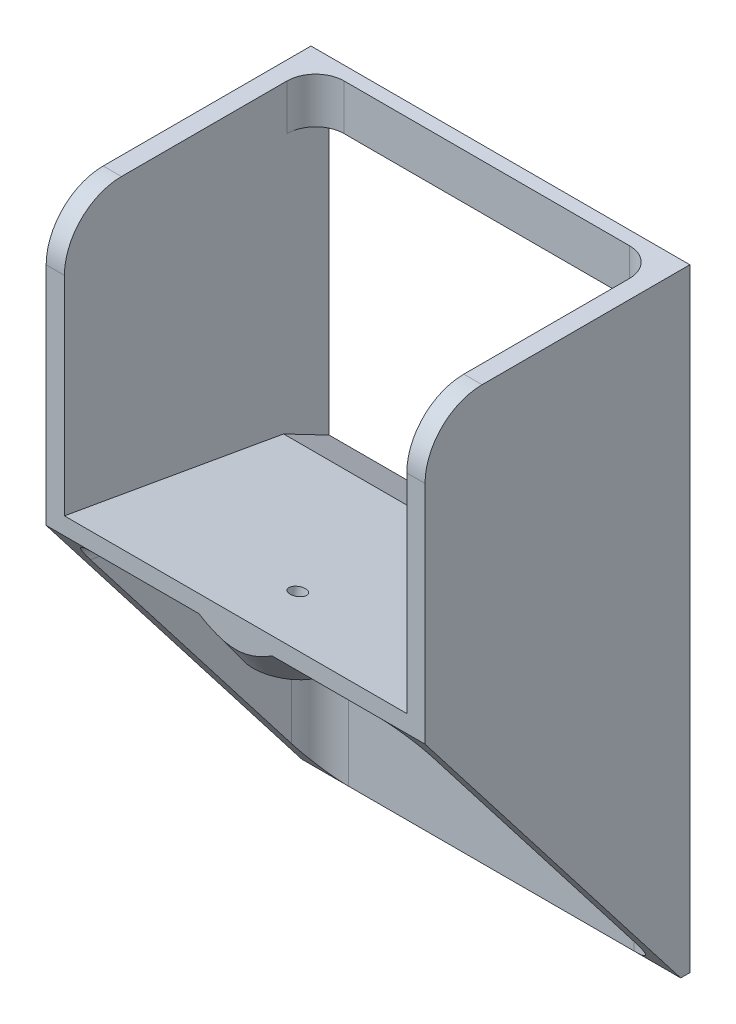
ISO-10303-21;
HEADER;
FILE_DESCRIPTION(('STEP AP214'),'2;1');
FILE_NAME('part.step','',(''),(''),'','','');
FILE_SCHEMA(('AUTOMOTIVE_DESIGN { 1 0 10303 214 1 1 1 1 }'));
ENDSEC;
DATA;
#1=APPLICATION_CONTEXT('core data for automotive mechanical design processes');
#2=APPLICATION_PROTOCOL_DEFINITION('international standard','automotive_design',2000,#1);
#3=PRODUCT_CONTEXT('',#1,'mechanical');
#4=PRODUCT('Part','Part','',(#3));
#5=PRODUCT_RELATED_PRODUCT_CATEGORY('part','',(#4));
#6=PRODUCT_DEFINITION_FORMATION('','',#4);
#7=PRODUCT_DEFINITION_CONTEXT('part definition',#1,'design');
#8=PRODUCT_DEFINITION('design','',#6,#7);
#9=PRODUCT_DEFINITION_SHAPE('','',#8);
#10=(LENGTH_UNIT() NAMED_UNIT(*) SI_UNIT(.MILLI.,.METRE.));
#11=(NAMED_UNIT(*) PLANE_ANGLE_UNIT() SI_UNIT($,.RADIAN.));
#12=(NAMED_UNIT(*) SI_UNIT($,.STERADIAN.) SOLID_ANGLE_UNIT());
#13=UNCERTAINTY_MEASURE_WITH_UNIT(LENGTH_MEASURE(1.E-05),#10,'distance_accuracy_value','');
#14=(GEOMETRIC_REPRESENTATION_CONTEXT(3) GLOBAL_UNCERTAINTY_ASSIGNED_CONTEXT((#13)) GLOBAL_UNIT_ASSIGNED_CONTEXT((#10,
#11,#12)) REPRESENTATION_CONTEXT('',''));
#15=CARTESIAN_POINT('',(0.,0.,0.));
#16=DIRECTION('',(0.,0.,1.));
#17=DIRECTION('',(1.,0.,0.));
#18=AXIS2_PLACEMENT_3D('',#15,#16,#17);
#19=CARTESIAN_POINT('',(30.,0.,0.));
#20=DIRECTION('',(1.,0.,0.));
#21=DIRECTION('',(0.,0.,-1.));
#22=AXIS2_PLACEMENT_3D('',#19,#20,#21);
#23=PLANE('',#22);
#24=DIRECTION('',(0.,-1.,0.));
#25=VECTOR('',#24,1.);
#26=CARTESIAN_POINT('',(30.,107.458907360345,46.4141984621045));
#27=LINE('',#26,#25);
#28=CARTESIAN_POINT('',(30.,97.4589073603453,46.4141984621045));
#29=VERTEX_POINT('',#28);
#30=CARTESIAN_POINT('',(30.,60.9482321433499,46.4141984621045));
#31=VERTEX_POINT('',#30);
#32=EDGE_CURVE('E240',#29,#31,#27,.T.);
#33=ORIENTED_EDGE('',*,*,#32,.F.);
#34=CARTESIAN_POINT('',(30.,97.4589073603452,36.4141984621041));
#35=DIRECTION('',(1.,0.,0.));
#36=DIRECTION('',(0.,0.,-1.));
#37=AXIS2_PLACEMENT_3D('',#34,#35,#36);
#38=CIRCLE('',#37,10.);
#39=CARTESIAN_POINT('',(30.,107.458907360345,36.4141984621041));
#40=VERTEX_POINT('',#39);
#41=EDGE_CURVE('E52',#29,#40,#38,.F.);
#42=ORIENTED_EDGE('',*,*,#41,.T.);
#43=DIRECTION('',(0.,0.,1.));
#44=VECTOR('',#43,1.);
#45=CARTESIAN_POINT('',(30.,107.458907360345,0.));
#46=LINE('',#45,#44);
#47=CARTESIAN_POINT('',(30.,107.458907360345,7.40000000000001));
#48=VERTEX_POINT('',#47);
#49=EDGE_CURVE('E234',#48,#40,#46,.T.);
#50=ORIENTED_EDGE('',*,*,#49,.F.);
#51=DIRECTION('',(0.,1.,0.));
#52=VECTOR('',#51,1.);
#53=CARTESIAN_POINT('',(30.,99.4589073602959,7.4));
#54=LINE('',#53,#52);
#55=CARTESIAN_POINT('',(30.,99.4589073602959,7.4));
#56=VERTEX_POINT('',#55);
#57=EDGE_CURVE('E224',#48,#56,#54,.F.);
#58=ORIENTED_EDGE('',*,*,#57,.T.);
#59=DIRECTION('',(0.,0.,1.));
#60=VECTOR('',#59,1.);
#61=CARTESIAN_POINT('',(30.,99.4589073602959,0.));
#62=LINE('',#61,#60);
#63=CARTESIAN_POINT('',(30.,99.4589073602959,0.));
#64=VERTEX_POINT('',#63);
#65=EDGE_CURVE('E208',#64,#56,#62,.T.);
#66=ORIENTED_EDGE('',*,*,#65,.F.);
#67=DIRECTION('',(0.,1.,0.));
#68=VECTOR('',#67,1.);
#69=CARTESIAN_POINT('',(30.,0.,0.));
#70=LINE('',#69,#68);
#71=CARTESIAN_POINT('',(30.,50.,0.));
#72=VERTEX_POINT('',#71);
#73=EDGE_CURVE('E221',#72,#64,#70,.T.);
#74=ORIENTED_EDGE('',*,*,#73,.F.);
#75=DIRECTION('',(0.,0.4626408705685,0.886545782731845));
#76=VECTOR('',#75,1.);
#77=CARTESIAN_POINT('',(30.,39.298171243981,-20.5076156360947));
#78=LINE('',#77,#76);
#79=CARTESIAN_POINT('',(30.,54.1747725121913,8.));
#80=VERTEX_POINT('',#79);
#81=EDGE_CURVE('E268',#72,#80,#78,.T.);
#82=ORIENTED_EDGE('',*,*,#81,.T.);
#83=DIRECTION('',(0.,0.173648177666931,0.984807753012208));
#84=VECTOR('',#83,1.);
#85=CARTESIAN_POINT('',(30.,51.1731226640236,-9.02320221277126));
#86=LINE('',#85,#84);
#87=EDGE_CURVE('E264',#80,#31,#86,.T.);
#88=ORIENTED_EDGE('',*,*,#87,.T.);
#89=EDGE_LOOP('',(#33,#42,#50,#58,#66,#74,#82,#88));
#90=FACE_BOUND('',#89,.T.);
#91=ADVANCED_FACE('F43',(#90),#23,.F.);
#92=CARTESIAN_POINT('',(-30.,0.,0.));
#93=DIRECTION('',(-1.,0.,0.));
#94=DIRECTION('',(0.,0.,-1.));
#95=AXIS2_PLACEMENT_3D('',#92,#93,#94);
#96=PLANE('',#95);
#97=DIRECTION('',(0.,0.,1.));
#98=VECTOR('',#97,1.);
#99=CARTESIAN_POINT('',(-30.,107.458907360345,0.));
#100=LINE('',#99,#98);
#101=CARTESIAN_POINT('',(-30.,107.458907360345,7.40000000000001));
#102=VERTEX_POINT('',#101);
#103=CARTESIAN_POINT('',(-30.,107.458907360345,36.4141984621041));
#104=VERTEX_POINT('',#103);
#105=EDGE_CURVE('E483',#102,#104,#100,.T.);
#106=ORIENTED_EDGE('',*,*,#105,.T.);
#107=CARTESIAN_POINT('',(-30.,97.4589073603452,36.4141984621041));
#108=DIRECTION('',(-1.,0.,0.));
#109=DIRECTION('',(0.,0.,1.));
#110=AXIS2_PLACEMENT_3D('',#107,#108,#109);
#111=CIRCLE('',#110,10.);
#112=CARTESIAN_POINT('',(-30.,97.4589073603453,46.4141984621045));
#113=VERTEX_POINT('',#112);
#114=EDGE_CURVE('E442',#104,#113,#111,.F.);
#115=ORIENTED_EDGE('',*,*,#114,.T.);
#116=DIRECTION('',(0.,-1.,0.));
#117=VECTOR('',#116,1.);
#118=CARTESIAN_POINT('',(-30.,107.458907360345,46.4141984621045));
#119=LINE('',#118,#117);
#120=CARTESIAN_POINT('',(-30.,60.9482321433499,46.4141984621045));
#121=VERTEX_POINT('',#120);
#122=EDGE_CURVE('E487',#113,#121,#119,.T.);
#123=ORIENTED_EDGE('',*,*,#122,.T.);
#124=DIRECTION('',(0.,0.173648177666931,0.984807753012208));
#125=VECTOR('',#124,1.);
#126=CARTESIAN_POINT('',(-30.,51.1731226640236,-9.02320221277126));
#127=LINE('',#126,#125);
#128=CARTESIAN_POINT('',(-30.,54.1747725121913,8.));
#129=VERTEX_POINT('',#128);
#130=EDGE_CURVE('E271',#129,#121,#127,.T.);
#131=ORIENTED_EDGE('',*,*,#130,.F.);
#132=DIRECTION('',(0.,0.4626408705685,0.886545782731845));
#133=VECTOR('',#132,1.);
#134=CARTESIAN_POINT('',(-30.,39.298171243981,-20.5076156360947));
#135=LINE('',#134,#133);
#136=CARTESIAN_POINT('',(-30.,50.,0.));
#137=VERTEX_POINT('',#136);
#138=EDGE_CURVE('E275',#137,#129,#135,.T.);
#139=ORIENTED_EDGE('',*,*,#138,.F.);
#140=DIRECTION('',(0.,1.,0.));
#141=VECTOR('',#140,1.);
#142=CARTESIAN_POINT('',(-30.,0.,0.));
#143=LINE('',#142,#141);
#144=CARTESIAN_POINT('',(-30.,99.4589073602959,0.));
#145=VERTEX_POINT('',#144);
#146=EDGE_CURVE('E479',#137,#145,#143,.T.);
#147=ORIENTED_EDGE('',*,*,#146,.T.);
#148=DIRECTION('',(0.,0.,1.));
#149=VECTOR('',#148,1.);
#150=CARTESIAN_POINT('',(-30.,99.4589073602959,0.));
#151=LINE('',#150,#149);
#152=CARTESIAN_POINT('',(-30.,99.4589073602959,7.4));
#153=VERTEX_POINT('',#152);
#154=EDGE_CURVE('E211',#145,#153,#151,.T.);
#155=ORIENTED_EDGE('',*,*,#154,.T.);
#156=DIRECTION('',(0.,1.,0.));
#157=VECTOR('',#156,1.);
#158=CARTESIAN_POINT('',(-30.,107.458907360296,7.40000000000001));
#159=LINE('',#158,#157);
#160=EDGE_CURVE('E409',#153,#102,#159,.T.);
#161=ORIENTED_EDGE('',*,*,#160,.T.);
#162=EDGE_LOOP('',(#106,#115,#123,#131,#139,#147,#155,#161));
#163=FACE_BOUND('',#162,.T.);
#164=ADVANCED_FACE('F338',(#163),#96,.F.);
#165=CARTESIAN_POINT('',(-30.,48.218699404987,-8.50225767977049));
#166=DIRECTION('',(0.,0.984807753012208,-0.173648177666932));
#167=DIRECTION('',(0.,0.173648177666932,0.984807753012208));
#168=AXIS2_PLACEMENT_3D('',#165,#166,#167);
#169=PLANE('',#168);
#170=DIRECTION('',(1.,0.,0.));
#171=VECTOR('',#170,1.);
#172=CARTESIAN_POINT('',(-30.,57.9019523076927,46.4141984621045));
#173=LINE('',#172,#171);
#174=CARTESIAN_POINT('',(-25.,57.9019523076927,46.4141984621045));
#175=VERTEX_POINT('',#174);
#176=CARTESIAN_POINT('',(-6.42331588124305,57.9019523076927,46.4141984621045));
#177=VERTEX_POINT('',#176);
#178=EDGE_CURVE('E294',#175,#177,#173,.T.);
#179=ORIENTED_EDGE('',*,*,#178,.F.);
#180=DIRECTION('',(0.,0.173648177666932,0.984807753012208));
#181=VECTOR('',#180,1.);
#182=CARTESIAN_POINT('',(-25.,49.9999999999998,1.6));
#183=LINE('',#182,#181);
#184=CARTESIAN_POINT('',(-25.,50.7285406091745,5.73175911166534));
#185=VERTEX_POINT('',#184);
#186=EDGE_CURVE('E554',#175,#185,#183,.F.);
#187=ORIENTED_EDGE('',*,*,#186,.T.);
#188=DIRECTION('',(1.,0.,0.));
#189=VECTOR('',#188,1.);
#190=CARTESIAN_POINT('',(30.,50.7285406091745,5.73175911166534));
#191=LINE('',#190,#189);
#192=CARTESIAN_POINT('',(25.,50.7285406091745,5.73175911166534));
#193=VERTEX_POINT('',#192);
#194=EDGE_CURVE('E552',#185,#193,#191,.T.);
#195=ORIENTED_EDGE('',*,*,#194,.T.);
#196=DIRECTION('',(0.,0.173648177666932,0.984807753012208));
#197=VECTOR('',#196,1.);
#198=CARTESIAN_POINT('',(25.,57.9019523076927,46.4141984621045));
#199=LINE('',#198,#197);
#200=CARTESIAN_POINT('',(25.,57.9019523076927,46.4141984621045));
#201=VERTEX_POINT('',#200);
#202=EDGE_CURVE('E393',#193,#201,#199,.T.);
#203=ORIENTED_EDGE('',*,*,#202,.T.);
#204=CARTESIAN_POINT('',(6.42331588124305,57.9019523076927,46.4141984621045));
#205=VERTEX_POINT('',#204);
#206=EDGE_CURVE('E297',#205,#201,#173,.T.);
#207=ORIENTED_EDGE('',*,*,#206,.F.);
#208=CARTESIAN_POINT('',(0.,56.0702849147694,36.026296477032));
#209=DIRECTION('',(0.,0.984807753012208,-0.173648177666932));
#210=DIRECTION('',(0.,0.173648177666932,0.984807753012208));
#211=AXIS2_PLACEMENT_3D('',#208,#209,#210);
#212=CIRCLE('',#211,12.35);
#213=EDGE_CURVE('E284',#205,#177,#212,.T.);
#214=ORIENTED_EDGE('',*,*,#213,.T.);
#215=EDGE_LOOP('',(#179,#187,#195,#203,#207,#214));
#216=FACE_BOUND('',#215,.T.);
#217=ADVANCED_FACE('F326',(#216),#169,.F.);
#218=CARTESIAN_POINT('',(-30.,51.1731226640236,-9.02320221277126));
#219=DIRECTION('',(0.,0.984807753012208,-0.173648177666931));
#220=DIRECTION('',(0.,0.173648177666931,0.984807753012208));
#221=AXIS2_PLACEMENT_3D('',#218,#219,#220);
#222=PLANE('',#221);
#223=CARTESIAN_POINT('',(0.,59.0247081738061,35.5053519440312));
#224=DIRECTION('',(0.,0.984807753012208,-0.173648177666931));
#225=DIRECTION('',(0.,0.173648177666931,0.984807753012208));
#226=AXIS2_PLACEMENT_3D('',#223,#224,#225);
#227=CIRCLE('',#226,1.34999999999999);
#228=CARTESIAN_POINT('',(0.,59.2591332136564,36.8348424105977));
#229=VERTEX_POINT('',#228);
#230=EDGE_CURVE('E494',#229,#229,#227,.T.);
#231=ORIENTED_EDGE('',*,*,#230,.F.);
#232=EDGE_LOOP('',(#231));
#233=FACE_BOUND('',#232,.T.);
#234=DIRECTION('',(1.,0.,0.));
#235=VECTOR('',#234,1.);
#236=CARTESIAN_POINT('',(-30.,60.9482321433499,46.4141984621045));
#237=LINE('',#236,#235);
#238=EDGE_CURVE('E279',#121,#31,#237,.T.);
#239=ORIENTED_EDGE('',*,*,#238,.T.);
#240=ORIENTED_EDGE('',*,*,#87,.F.);
#241=DIRECTION('',(1.,0.,0.));
#242=VECTOR('',#241,1.);
#243=CARTESIAN_POINT('',(-30.,54.1747725121913,8.));
#244=LINE('',#243,#242);
#245=EDGE_CURVE('E280',#129,#80,#244,.T.);
#246=ORIENTED_EDGE('',*,*,#245,.F.);
#247=ORIENTED_EDGE('',*,*,#130,.T.);
#248=EDGE_LOOP('',(#239,#240,#246,#247));
#249=FACE_BOUND('',#248,.T.);
#250=ADVANCED_FACE('F328',(#233,#249),#222,.T.);
#251=CARTESIAN_POINT('',(-30.,39.298171243981,-20.5076156360947));
#252=DIRECTION('',(0.,0.886545782731845,-0.4626408705685));
#253=DIRECTION('',(0.,0.4626408705685,0.886545782731845));
#254=AXIS2_PLACEMENT_3D('',#251,#252,#253);
#255=PLANE('',#254);
#256=ORIENTED_EDGE('',*,*,#245,.T.);
#257=ORIENTED_EDGE('',*,*,#81,.F.);
#258=DIRECTION('',(1.,0.,0.));
#259=VECTOR('',#258,1.);
#260=CARTESIAN_POINT('',(-30.,50.,0.));
#261=LINE('',#260,#259);
#262=EDGE_CURVE('E231',#137,#72,#261,.T.);
#263=ORIENTED_EDGE('',*,*,#262,.F.);
#264=ORIENTED_EDGE('',*,*,#138,.T.);
#265=EDGE_LOOP('',(#256,#257,#263,#264));
#266=FACE_BOUND('',#265,.T.);
#267=ADVANCED_FACE('F330',(#266),#255,.T.);
#268=CARTESIAN_POINT('',(-30.,0.,0.));
#269=DIRECTION('',(0.,0.,-1.));
#270=DIRECTION('',(-1.,0.,0.));
#271=AXIS2_PLACEMENT_3D('',#268,#269,#270);
#272=PLANE('',#271);
#273=ORIENTED_EDGE('',*,*,#73,.T.);
#274=DIRECTION('',(1.,0.,0.));
#275=VECTOR('',#274,1.);
#276=CARTESIAN_POINT('',(-38.3522452071284,99.4589073602959,0.));
#277=LINE('',#276,#275);
#278=EDGE_CURVE('E205',#145,#64,#277,.T.);
#279=ORIENTED_EDGE('',*,*,#278,.F.);
#280=ORIENTED_EDGE('',*,*,#146,.F.);
#281=ORIENTED_EDGE('',*,*,#262,.T.);
#282=EDGE_LOOP('',(#273,#279,#280,#281));
#283=FACE_BOUND('',#282,.T.);
#284=DIRECTION('',(0.,1.,0.));
#285=VECTOR('',#284,1.);
#286=CARTESIAN_POINT('',(-33.2,0.,0.));
#287=LINE('',#286,#285);
#288=CARTESIAN_POINT('',(-33.2,0.,0.));
#289=VERTEX_POINT('',#288);
#290=CARTESIAN_POINT('',(-33.2,107.458907360345,0.));
#291=VERTEX_POINT('',#290);
#292=EDGE_CURVE('E478',#289,#291,#287,.T.);
#293=ORIENTED_EDGE('',*,*,#292,.T.);
#294=DIRECTION('',(-1.,0.,0.));
#295=VECTOR('',#294,1.);
#296=CARTESIAN_POINT('',(33.2,107.458907360345,0.));
#297=LINE('',#296,#295);
#298=CARTESIAN_POINT('',(33.2,107.458907360345,0.));
#299=VERTEX_POINT('',#298);
#300=EDGE_CURVE('E261',#299,#291,#297,.T.);
#301=ORIENTED_EDGE('',*,*,#300,.F.);
#302=DIRECTION('',(0.,1.,0.));
#303=VECTOR('',#302,1.);
#304=CARTESIAN_POINT('',(33.2,0.,0.));
#305=LINE('',#304,#303);
#306=CARTESIAN_POINT('',(33.2,0.,0.));
#307=VERTEX_POINT('',#306);
#308=EDGE_CURVE('E468',#307,#299,#305,.T.);
#309=ORIENTED_EDGE('',*,*,#308,.F.);
#310=DIRECTION('',(1.,0.,0.));
#311=VECTOR('',#310,1.);
#312=CARTESIAN_POINT('',(-30.,0.,0.));
#313=LINE('',#312,#311);
#314=EDGE_CURVE('E287',#289,#307,#313,.T.);
#315=ORIENTED_EDGE('',*,*,#314,.F.);
#316=EDGE_LOOP('',(#293,#301,#309,#315));
#317=FACE_BOUND('',#316,.T.);
#318=ADVANCED_FACE('F229',(#283,#317),#272,.T.);
#319=CARTESIAN_POINT('',(-30.,0.,0.));
#320=DIRECTION('',(0.,1.,0.));
#321=DIRECTION('',(0.,0.,1.));
#322=AXIS2_PLACEMENT_3D('',#319,#320,#321);
#323=PLANE('',#322);
#324=ORIENTED_EDGE('',*,*,#314,.T.);
#325=DIRECTION('',(0.,0.,-1.));
#326=VECTOR('',#325,1.);
#327=CARTESIAN_POINT('',(33.2,0.,1.6));
#328=LINE('',#327,#326);
#329=CARTESIAN_POINT('',(33.2,0.,1.6));
#330=VERTEX_POINT('',#329);
#331=EDGE_CURVE('E254',#330,#307,#328,.T.);
#332=ORIENTED_EDGE('',*,*,#331,.F.);
#333=DIRECTION('',(-1.,0.,0.));
#334=VECTOR('',#333,1.);
#335=CARTESIAN_POINT('',(33.2,0.,1.6));
#336=LINE('',#335,#334);
#337=CARTESIAN_POINT('',(25.,0.,1.6));
#338=VERTEX_POINT('',#337);
#339=EDGE_CURVE('E255',#330,#338,#336,.T.);
#340=ORIENTED_EDGE('',*,*,#339,.T.);
#341=DIRECTION('',(1.,0.,0.));
#342=VECTOR('',#341,1.);
#343=CARTESIAN_POINT('',(-30.,0.,1.6));
#344=LINE('',#343,#342);
#345=CARTESIAN_POINT('',(-25.,0.,1.6));
#346=VERTEX_POINT('',#345);
#347=EDGE_CURVE('E290',#346,#338,#344,.T.);
#348=ORIENTED_EDGE('',*,*,#347,.F.);
#349=DIRECTION('',(1.,0.,0.));
#350=VECTOR('',#349,1.);
#351=CARTESIAN_POINT('',(-33.2,0.,1.6));
#352=LINE('',#351,#350);
#353=CARTESIAN_POINT('',(-33.2,0.,1.6));
#354=VERTEX_POINT('',#353);
#355=EDGE_CURVE('E235',#354,#346,#352,.T.);
#356=ORIENTED_EDGE('',*,*,#355,.F.);
#357=DIRECTION('',(0.,0.,-1.));
#358=VECTOR('',#357,1.);
#359=CARTESIAN_POINT('',(-33.2,0.,1.6));
#360=LINE('',#359,#358);
#361=EDGE_CURVE('E482',#354,#289,#360,.T.);
#362=ORIENTED_EDGE('',*,*,#361,.T.);
#363=EDGE_LOOP('',(#324,#332,#340,#348,#356,#362));
#364=FACE_BOUND('',#363,.T.);
#365=ADVANCED_FACE('F598',(#364),#323,.F.);
#366=CARTESIAN_POINT('',(-30.,0.,1.6));
#367=DIRECTION('',(0.,0.,-1.));
#368=DIRECTION('',(-1.,0.,0.));
#369=AXIS2_PLACEMENT_3D('',#366,#367,#368);
#370=PLANE('',#369);
#371=DIRECTION('',(1.,0.,0.));
#372=VECTOR('',#371,1.);
#373=CARTESIAN_POINT('',(-30.,45.8045018441134,1.6));
#374=LINE('',#373,#372);
#375=CARTESIAN_POINT('',(25.,45.8045018441134,1.6));
#376=VERTEX_POINT('',#375);
#377=CARTESIAN_POINT('',(-25.,45.8045018441134,1.6));
#378=VERTEX_POINT('',#377);
#379=EDGE_CURVE('E551',#376,#378,#374,.F.);
#380=ORIENTED_EDGE('',*,*,#379,.T.);
#381=DIRECTION('',(0.,1.,0.));
#382=VECTOR('',#381,1.);
#383=CARTESIAN_POINT('',(-25.,0.,1.6));
#384=LINE('',#383,#382);
#385=EDGE_CURVE('E373',#378,#346,#384,.F.);
#386=ORIENTED_EDGE('',*,*,#385,.T.);
#387=ORIENTED_EDGE('',*,*,#347,.T.);
#388=DIRECTION('',(0.,1.,0.));
#389=VECTOR('',#388,1.);
#390=CARTESIAN_POINT('',(25.,49.9999999999998,1.6));
#391=LINE('',#390,#389);
#392=EDGE_CURVE('E558',#338,#376,#391,.T.);
#393=ORIENTED_EDGE('',*,*,#392,.T.);
#394=EDGE_LOOP('',(#380,#386,#387,#393));
#395=FACE_BOUND('',#394,.T.);
#396=ADVANCED_FACE('F325',(#395),#370,.F.);
#397=CARTESIAN_POINT('',(-30.,5.28617225170252E-13,46.4141984621052));
#398=DIRECTION('',(0.,0.,1.));
#399=DIRECTION('',(0.,-1.,0.));
#400=AXIS2_PLACEMENT_3D('',#397,#398,#399);
#401=PLANE('',#400);
#402=ORIENTED_EDGE('',*,*,#122,.F.);
#403=DIRECTION('',(1.,0.,0.));
#404=VECTOR('',#403,1.);
#405=CARTESIAN_POINT('',(-33.2,97.4589073603453,46.4141984621041));
#406=LINE('',#405,#404);
#407=CARTESIAN_POINT('',(-33.2,97.4589073603453,46.4141984621045));
#408=VERTEX_POINT('',#407);
#409=EDGE_CURVE('E59',#113,#408,#406,.F.);
#410=ORIENTED_EDGE('',*,*,#409,.T.);
#411=DIRECTION('',(0.,-1.,0.));
#412=VECTOR('',#411,1.);
#413=CARTESIAN_POINT('',(-33.2,107.458907360345,46.4141984621045));
#414=LINE('',#413,#412);
#415=CARTESIAN_POINT('',(-33.2,57.9019523076927,46.4141984621045));
#416=VERTEX_POINT('',#415);
#417=EDGE_CURVE('E501',#408,#416,#414,.T.);
#418=ORIENTED_EDGE('',*,*,#417,.T.);
#419=DIRECTION('',(1.,0.,0.));
#420=VECTOR('',#419,1.);
#421=CARTESIAN_POINT('',(-33.2,57.9019523076927,46.4141984621045));
#422=LINE('',#421,#420);
#423=EDGE_CURVE('E242',#416,#175,#422,.T.);
#424=ORIENTED_EDGE('',*,*,#423,.T.);
#425=ORIENTED_EDGE('',*,*,#178,.T.);
#426=CARTESIAN_POINT('',(-6.42331588124305,57.9019523076927,46.4141984621045));
#427=CARTESIAN_POINT('',(-6.26439593139787,57.8031556321546,46.4141984621045));
#428=CARTESIAN_POINT('',(-6.10443126975021,57.7060151763486,46.4141984621045));
#429=CARTESIAN_POINT('',(-5.78217947743647,57.5155702634718,46.4141984621045));
#430=CARTESIAN_POINT('',(-5.61989173741623,57.4222668386825,46.4141984621045));
#431=CARTESIAN_POINT('',(-5.29210777390077,57.2396619729198,46.4141984621045));
#432=CARTESIAN_POINT('',(-5.1266003786054,57.1503804856044,46.4141984621045));
#433=CARTESIAN_POINT('',(-4.79293191611986,56.9769653003287,46.4141984621045));
#434=CARTESIAN_POINT('',(-4.6247710323839,56.8928312484348,46.4141984621045));
#435=CARTESIAN_POINT('',(-4.10935937560402,56.6460711785689,46.4141984621045));
#436=CARTESIAN_POINT('',(-3.75756677374156,56.4927161221843,46.4141984621045));
#437=CARTESIAN_POINT('',(-3.04188202735353,56.2187057802107,46.4141984621045));
#438=CARTESIAN_POINT('',(-2.67801307014992,56.0979914869066,46.4141984621045));
#439=CARTESIAN_POINT('',(-2.0669846617319,55.9328502740829,46.4141984621045));
#440=CARTESIAN_POINT('',(-1.82305496981243,55.8764820686315,46.4141984621045));
#441=CARTESIAN_POINT('',(-1.33131205210018,55.7839835124456,46.4141984621045));
#442=CARTESIAN_POINT('',(-1.08349871579766,55.7478537386778,46.4141984621045));
#443=CARTESIAN_POINT('',(-0.587968175075757,55.6979289325463,46.4141984621045));
#444=CARTESIAN_POINT('',(-0.34027217799189,55.6839261321277,46.4141984621045));
#445=CARTESIAN_POINT('',(0.155365249435748,55.6783682293351,46.4141984621045));
#446=CARTESIAN_POINT('',(0.40330666972946,55.686812242927,46.4141984621045));
#447=CARTESIAN_POINT('',(0.897013156804226,55.7256491873362,46.4141984621045));
#448=CARTESIAN_POINT('',(1.14278124735932,55.7560041088122,46.4141984621045));
#449=CARTESIAN_POINT('',(1.63088787294762,55.8370389475244,46.4141984621045));
#450=CARTESIAN_POINT('',(1.87322604327814,55.8877210095801,46.4141984621045));
#451=CARTESIAN_POINT('',(2.59754574583653,56.0679517047776,46.4141984621045));
#452=CARTESIAN_POINT('',(3.07272018280399,56.2252995271422,46.4141984621045));
#453=CARTESIAN_POINT('',(3.79121755091877,56.5098806976264,46.4141984621045));
#454=CARTESIAN_POINT('',(4.04236974853014,56.618642795611,46.4141984621045));
#455=CARTESIAN_POINT('',(4.53871597514699,56.8493002295549,46.4141984621045));
#456=CARTESIAN_POINT('',(4.78390817898631,56.9711995280203,46.4141984621045));
#457=CARTESIAN_POINT('',(5.26430357865823,57.22334708926,46.4141984621045));
#458=CARTESIAN_POINT('',(5.49960701940132,57.3534068089431,46.4141984621045));
#459=CARTESIAN_POINT('',(5.96509019944598,57.6218540838451,46.4141984621045));
#460=CARTESIAN_POINT('',(6.19527517651469,57.7602325331518,46.4141984621045));
#461=CARTESIAN_POINT('',(6.42331588124305,57.9019523076927,46.4141984621045));
#462=B_SPLINE_CURVE_WITH_KNOTS('',3,(#426,#427,#428,#429,#430,#431,#432,#433,#434,#435,#436,
#437,#438,#439,#440,#441,#442,#443,#444,#445,#446,#447,#448,#449,#450,#451,#452,#453,#454,#455,
#456,#457,#458,#459,#460,#461),.UNSPECIFIED.,.F.,.F.,(4,2,2,2,2,2,2,2,2,2,2,2,2,2,2,2,2,4),(0.,
0.561387489664002,1.12292503507966,1.68699591589626,2.25102796794616,3.4010872056482,
4.54905326020081,5.29939593791521,6.04976000566082,6.79303551630654,7.53628175458879,
8.27824175610839,9.02028006618695,10.5166098965658,11.3374506853978,12.158539756826,
12.9649288230825,13.7704507223679),.UNSPECIFIED.);
#463=EDGE_CURVE('E304',#177,#205,#462,.T.);
#464=ORIENTED_EDGE('',*,*,#463,.T.);
#465=ORIENTED_EDGE('',*,*,#206,.T.);
#466=DIRECTION('',(-1.,0.,0.));
#467=VECTOR('',#466,1.);
#468=CARTESIAN_POINT('',(33.2,57.9019523076927,46.4141984621045));
#469=LINE('',#468,#467);
#470=CARTESIAN_POINT('',(33.2,57.9019523076927,46.4141984621045));
#471=VERTEX_POINT('',#470);
#472=EDGE_CURVE('E258',#471,#201,#469,.T.);
#473=ORIENTED_EDGE('',*,*,#472,.F.);
#474=DIRECTION('',(0.,-1.,0.));
#475=VECTOR('',#474,1.);
#476=CARTESIAN_POINT('',(33.2,107.458907360345,46.4141984621045));
#477=LINE('',#476,#475);
#478=CARTESIAN_POINT('',(33.2,97.4589073603453,46.4141984621045));
#479=VERTEX_POINT('',#478);
#480=EDGE_CURVE('E460',#479,#471,#477,.T.);
#481=ORIENTED_EDGE('',*,*,#480,.F.);
#482=DIRECTION('',(-1.,0.,0.));
#483=VECTOR('',#482,1.);
#484=CARTESIAN_POINT('',(30.,97.4589073603453,46.4141984621041));
#485=LINE('',#484,#483);
#486=EDGE_CURVE('E445',#479,#29,#485,.T.);
#487=ORIENTED_EDGE('',*,*,#486,.T.);
#488=ORIENTED_EDGE('',*,*,#32,.T.);
#489=ORIENTED_EDGE('',*,*,#238,.F.);
#490=EDGE_LOOP('',(#402,#410,#418,#424,#425,#464,#465,#473,#481,#487,#488,#489));
#491=FACE_BOUND('',#490,.T.);
#492=ADVANCED_FACE('F320',(#491),#401,.T.);
#493=CARTESIAN_POINT('',(33.2,107.458907360345,0.));
#494=DIRECTION('',(0.,-1.,0.));
#495=DIRECTION('',(0.,0.,-1.));
#496=AXIS2_PLACEMENT_3D('',#493,#494,#495);
#497=PLANE('',#496);
#498=DIRECTION('',(0.,0.,1.));
#499=VECTOR('',#498,1.);
#500=CARTESIAN_POINT('',(-33.2,107.458907360345,0.));
#501=LINE('',#500,#499);
#502=CARTESIAN_POINT('',(-33.2,107.458907360345,36.4141984621041));
#503=VERTEX_POINT('',#502);
#504=EDGE_CURVE('E498',#291,#503,#501,.T.);
#505=ORIENTED_EDGE('',*,*,#504,.T.);
#506=DIRECTION('',(1.,0.,0.));
#507=VECTOR('',#506,1.);
#508=CARTESIAN_POINT('',(-30.,107.458907360345,36.4141984621041));
#509=LINE('',#508,#507);
#510=EDGE_CURVE('E438',#503,#104,#509,.T.);
#511=ORIENTED_EDGE('',*,*,#510,.T.);
#512=ORIENTED_EDGE('',*,*,#105,.F.);
#513=CARTESIAN_POINT('',(-25.,107.458907360345,7.40000000000001));
#514=DIRECTION('',(0.,-1.,0.));
#515=DIRECTION('',(0.,0.,-1.));
#516=AXIS2_PLACEMENT_3D('',#513,#514,#515);
#517=CIRCLE('',#516,5.);
#518=CARTESIAN_POINT('',(-25.,107.458907360296,2.40000000000001));
#519=VERTEX_POINT('',#518);
#520=EDGE_CURVE('E423',#102,#519,#517,.T.);
#521=ORIENTED_EDGE('',*,*,#520,.T.);
#522=DIRECTION('',(1.,0.,0.));
#523=VECTOR('',#522,1.);
#524=CARTESIAN_POINT('',(-38.3522452071284,107.458907360296,2.40000000000001));
#525=LINE('',#524,#523);
#526=CARTESIAN_POINT('',(25.,107.458907360296,2.40000000000001));
#527=VERTEX_POINT('',#526);
#528=EDGE_CURVE('E521',#519,#527,#525,.T.);
#529=ORIENTED_EDGE('',*,*,#528,.T.);
#530=CARTESIAN_POINT('',(25.,107.458907360345,7.40000000000001));
#531=DIRECTION('',(0.,-1.,0.));
#532=DIRECTION('',(0.,0.,-1.));
#533=AXIS2_PLACEMENT_3D('',#530,#531,#532);
#534=CIRCLE('',#533,5.);
#535=EDGE_CURVE('E429',#527,#48,#534,.T.);
#536=ORIENTED_EDGE('',*,*,#535,.T.);
#537=ORIENTED_EDGE('',*,*,#49,.T.);
#538=DIRECTION('',(-1.,0.,0.));
#539=VECTOR('',#538,1.);
#540=CARTESIAN_POINT('',(33.2,107.458907360345,36.4141984621041));
#541=LINE('',#540,#539);
#542=CARTESIAN_POINT('',(33.2,107.458907360345,36.4141984621041));
#543=VERTEX_POINT('',#542);
#544=EDGE_CURVE('E435',#40,#543,#541,.F.);
#545=ORIENTED_EDGE('',*,*,#544,.T.);
#546=DIRECTION('',(0.,0.,1.));
#547=VECTOR('',#546,1.);
#548=CARTESIAN_POINT('',(33.2,107.458907360345,0.));
#549=LINE('',#548,#547);
#550=EDGE_CURVE('E462',#299,#543,#549,.T.);
#551=ORIENTED_EDGE('',*,*,#550,.F.);
#552=ORIENTED_EDGE('',*,*,#300,.T.);
#553=EDGE_LOOP('',(#505,#511,#512,#521,#529,#536,#537,#545,#551,#552));
#554=FACE_BOUND('',#553,.T.);
#555=ADVANCED_FACE('F324',(#554),#497,.F.);
#556=CARTESIAN_POINT('',(33.2,57.9019523076927,46.4141984621045));
#557=DIRECTION('',(0.,0.61206115423805,-0.790810434600344));
#558=DIRECTION('',(0.,0.790810434600344,0.61206115423805));
#559=AXIS2_PLACEMENT_3D('',#556,#557,#558);
#560=PLANE('',#559);
#561=ORIENTED_EDGE('',*,*,#472,.T.);
#562=CARTESIAN_POINT('',(25.,52.0224339823557,41.8636454912295));
#563=DIRECTION('',(0.,0.61206115423805,-0.790810434600344));
#564=DIRECTION('',(0.,-0.790810434600344,-0.61206115423805));
#565=AXIS2_PLACEMENT_3D('',#562,#563,#564);
#566=ELLIPSE('',#565,7.43480114587565,5.);
#567=CARTESIAN_POINT('',(30.,52.0224339823557,41.8636454912295));
#568=VERTEX_POINT('',#567);
#569=EDGE_CURVE('E414',#201,#568,#566,.T.);
#570=ORIENTED_EDGE('',*,*,#569,.T.);
#571=DIRECTION('',(0.,-0.790810434600344,-0.61206115423805));
#572=VECTOR('',#571,1.);
#573=CARTESIAN_POINT('',(30.,57.9019523076927,46.4141984621045));
#574=LINE('',#573,#572);
#575=CARTESIAN_POINT('',(30.,6.46022402438542,6.6));
#576=VERTEX_POINT('',#575);
#577=EDGE_CURVE('E250',#568,#576,#574,.T.);
#578=ORIENTED_EDGE('',*,*,#577,.T.);
#579=CARTESIAN_POINT('',(25.,6.46022402438542,6.6));
#580=DIRECTION('',(0.,0.61206115423805,-0.790810434600344));
#581=DIRECTION('',(0.,-0.790810434600344,-0.61206115423805));
#582=AXIS2_PLACEMENT_3D('',#579,#580,#581);
#583=ELLIPSE('',#582,8.16911833953007,5.);
#584=EDGE_CURVE('E384',#576,#338,#583,.T.);
#585=ORIENTED_EDGE('',*,*,#584,.T.);
#586=ORIENTED_EDGE('',*,*,#339,.F.);
#587=DIRECTION('',(0.,-0.790810434600344,-0.61206115423805));
#588=VECTOR('',#587,1.);
#589=CARTESIAN_POINT('',(33.2,57.9019523076927,46.4141984621045));
#590=LINE('',#589,#588);
#591=EDGE_CURVE('E245',#471,#330,#590,.T.);
#592=ORIENTED_EDGE('',*,*,#591,.F.);
#593=EDGE_LOOP('',(#561,#570,#578,#585,#586,#592));
#594=FACE_BOUND('',#593,.T.);
#595=ADVANCED_FACE('F362',(#594),#560,.F.);
#596=CARTESIAN_POINT('',(33.2,0.,0.));
#597=DIRECTION('',(1.,0.,0.));
#598=DIRECTION('',(0.,0.,-1.));
#599=AXIS2_PLACEMENT_3D('',#596,#597,#598);
#600=PLANE('',#599);
#601=ORIENTED_EDGE('',*,*,#550,.T.);
#602=CARTESIAN_POINT('',(33.2,97.4589073603452,36.4141984621041));
#603=DIRECTION('',(1.,0.,0.));
#604=DIRECTION('',(0.,0.,-1.));
#605=AXIS2_PLACEMENT_3D('',#602,#603,#604);
#606=CIRCLE('',#605,10.);
#607=EDGE_CURVE('E11',#543,#479,#606,.T.);
#608=ORIENTED_EDGE('',*,*,#607,.T.);
#609=ORIENTED_EDGE('',*,*,#480,.T.);
#610=ORIENTED_EDGE('',*,*,#591,.T.);
#611=ORIENTED_EDGE('',*,*,#331,.T.);
#612=ORIENTED_EDGE('',*,*,#308,.T.);
#613=EDGE_LOOP('',(#601,#608,#609,#610,#611,#612));
#614=FACE_BOUND('',#613,.T.);
#615=ADVANCED_FACE('F354',(#614),#600,.T.);
#616=DIRECTION('',(0.,0.173648177666932,0.984807753012208));
#617=VECTOR('',#616,1.);
#618=CARTESIAN_POINT('',(30.,45.0759612349388,2.46824088833466));
#619=LINE('',#618,#617);
#620=CARTESIAN_POINT('',(30.,45.8045018441134,6.6));
#621=VERTEX_POINT('',#620);
#622=EDGE_CURVE('E366',#568,#621,#619,.F.);
#623=ORIENTED_EDGE('',*,*,#622,.T.);
#624=DIRECTION('',(0.,1.,0.));
#625=VECTOR('',#624,1.);
#626=CARTESIAN_POINT('',(30.,0.,6.6));
#627=LINE('',#626,#625);
#628=EDGE_CURVE('E368',#621,#576,#627,.F.);
#629=ORIENTED_EDGE('',*,*,#628,.T.);
#630=ORIENTED_EDGE('',*,*,#577,.F.);
#631=EDGE_LOOP('',(#623,#629,#630));
#632=FACE_BOUND('',#631,.T.);
#633=ADVANCED_FACE('F344',(#632),#23,.F.);
#634=DIRECTION('',(0.,1.,0.));
#635=VECTOR('',#634,1.);
#636=CARTESIAN_POINT('',(-30.,49.9999999999998,6.6));
#637=LINE('',#636,#635);
#638=CARTESIAN_POINT('',(-30.,6.46022402438542,6.6));
#639=VERTEX_POINT('',#638);
#640=CARTESIAN_POINT('',(-30.,45.8045018441134,6.6));
#641=VERTEX_POINT('',#640);
#642=EDGE_CURVE('E313',#639,#641,#637,.T.);
#643=ORIENTED_EDGE('',*,*,#642,.T.);
#644=DIRECTION('',(0.,0.173648177666932,0.984807753012208));
#645=VECTOR('',#644,1.);
#646=CARTESIAN_POINT('',(-30.,52.9779135426317,47.2824393504392));
#647=LINE('',#646,#645);
#648=CARTESIAN_POINT('',(-30.,52.0224339823557,41.8636454912295));
#649=VERTEX_POINT('',#648);
#650=EDGE_CURVE('E560',#641,#649,#647,.T.);
#651=ORIENTED_EDGE('',*,*,#650,.T.);
#652=DIRECTION('',(0.,-0.790810434600344,-0.61206115423805));
#653=VECTOR('',#652,1.);
#654=CARTESIAN_POINT('',(-30.,57.9019523076927,46.4141984621045));
#655=LINE('',#654,#653);
#656=EDGE_CURVE('E490',#649,#639,#655,.T.);
#657=ORIENTED_EDGE('',*,*,#656,.T.);
#658=EDGE_LOOP('',(#643,#651,#657));
#659=FACE_BOUND('',#658,.T.);
#660=ADVANCED_FACE('F350',(#659),#96,.F.);
#661=CARTESIAN_POINT('',(-33.2,57.9019523076927,46.4141984621045));
#662=DIRECTION('',(0.,-0.61206115423805,0.790810434600344));
#663=DIRECTION('',(0.,-0.790810434600344,-0.61206115423805));
#664=AXIS2_PLACEMENT_3D('',#661,#662,#663);
#665=PLANE('',#664);
#666=ORIENTED_EDGE('',*,*,#656,.F.);
#667=CARTESIAN_POINT('',(-25.,52.0224339823557,41.8636454912295));
#668=DIRECTION('',(0.,-0.61206115423805,0.790810434600344));
#669=DIRECTION('',(0.,-0.790810434600344,-0.61206115423805));
#670=AXIS2_PLACEMENT_3D('',#667,#668,#669);
#671=ELLIPSE('',#670,7.43480114587565,5.);
#672=EDGE_CURVE('E386',#649,#175,#671,.F.);
#673=ORIENTED_EDGE('',*,*,#672,.T.);
#674=ORIENTED_EDGE('',*,*,#423,.F.);
#675=DIRECTION('',(0.,-0.790810434600344,-0.61206115423805));
#676=VECTOR('',#675,1.);
#677=CARTESIAN_POINT('',(-33.2,57.9019523076927,46.4141984621045));
#678=LINE('',#677,#676);
#679=EDGE_CURVE('E504',#416,#354,#678,.T.);
#680=ORIENTED_EDGE('',*,*,#679,.T.);
#681=ORIENTED_EDGE('',*,*,#355,.T.);
#682=CARTESIAN_POINT('',(-25.,6.46022402438542,6.6));
#683=DIRECTION('',(0.,-0.61206115423805,0.790810434600344));
#684=DIRECTION('',(0.,-0.790810434600344,-0.61206115423805));
#685=AXIS2_PLACEMENT_3D('',#682,#683,#684);
#686=ELLIPSE('',#685,8.16911833953007,5.);
#687=EDGE_CURVE('E573',#346,#639,#686,.F.);
#688=ORIENTED_EDGE('',*,*,#687,.T.);
#689=EDGE_LOOP('',(#666,#673,#674,#680,#681,#688));
#690=FACE_BOUND('',#689,.T.);
#691=ADVANCED_FACE('F360',(#690),#665,.T.);
#692=CARTESIAN_POINT('',(-33.2,0.,0.));
#693=DIRECTION('',(-1.,0.,0.));
#694=DIRECTION('',(0.,0.,-1.));
#695=AXIS2_PLACEMENT_3D('',#692,#693,#694);
#696=PLANE('',#695);
#697=ORIENTED_EDGE('',*,*,#417,.F.);
#698=CARTESIAN_POINT('',(-33.2,97.4589073603452,36.4141984621041));
#699=DIRECTION('',(-1.,0.,0.));
#700=DIRECTION('',(0.,0.,1.));
#701=AXIS2_PLACEMENT_3D('',#698,#699,#700);
#702=CIRCLE('',#701,10.);
#703=EDGE_CURVE('E450',#408,#503,#702,.T.);
#704=ORIENTED_EDGE('',*,*,#703,.T.);
#705=ORIENTED_EDGE('',*,*,#504,.F.);
#706=ORIENTED_EDGE('',*,*,#292,.F.);
#707=ORIENTED_EDGE('',*,*,#361,.F.);
#708=ORIENTED_EDGE('',*,*,#679,.F.);
#709=EDGE_LOOP('',(#697,#704,#705,#706,#707,#708));
#710=FACE_BOUND('',#709,.T.);
#711=ADVANCED_FACE('F607',(#710),#696,.T.);
#712=CARTESIAN_POINT('',(0.,-0.085709895395171,45.9281134905886));
#713=DIRECTION('',(0.,0.984807753012208,-0.173648177666931));
#714=DIRECTION('',(0.,0.173648177666931,0.984807753012208));
#715=AXIS2_PLACEMENT_3D('',#712,#713,#714);
#716=CYLINDRICAL_SURFACE('',#715,1.34999999999999);
#717=ORIENTED_EDGE('',*,*,#230,.T.);
#718=EDGE_LOOP('',(#717));
#719=FACE_BOUND('',#718,.T.);
#720=CARTESIAN_POINT('',(0.,50.1614383966962,37.0681855430336));
#721=DIRECTION('',(0.,-0.984807753012208,0.173648177666932));
#722=DIRECTION('',(0.,-0.173648177666932,-0.984807753012208));
#723=AXIS2_PLACEMENT_3D('',#720,#721,#722);
#724=CIRCLE('',#723,1.35);
#725=CARTESIAN_POINT('',(0.,49.9270133568458,35.7386950764672));
#726=VERTEX_POINT('',#725);
#727=EDGE_CURVE('E397',#726,#726,#724,.T.);
#728=ORIENTED_EDGE('',*,*,#727,.T.);
#729=EDGE_LOOP('',(#728));
#730=FACE_BOUND('',#729,.T.);
#731=ADVANCED_FACE('F658',(#719,#730),#716,.F.);
#732=CARTESIAN_POINT('',(0.,50.1614383966962,37.0681855430336));
#733=DIRECTION('',(0.,-0.984807753012208,0.173648177666932));
#734=DIRECTION('',(0.,-0.173648177666932,-0.984807753012208));
#735=AXIS2_PLACEMENT_3D('',#732,#733,#734);
#736=PLANE('',#735);
#737=CARTESIAN_POINT('',(0.,50.1614383966962,37.0681855430336));
#738=DIRECTION('',(0.,-0.984807753012208,0.173648177666932));
#739=DIRECTION('',(0.,-0.173648177666932,-0.984807753012208));
#740=AXIS2_PLACEMENT_3D('',#737,#738,#739);
#741=CIRCLE('',#740,6.35);
#742=CARTESIAN_POINT('',(0.,49.0587724685112,30.8146563114061));
#743=VERTEX_POINT('',#742);
#744=EDGE_CURVE('E514',#743,#743,#741,.T.);
#745=ORIENTED_EDGE('',*,*,#744,.T.);
#746=EDGE_LOOP('',(#745));
#747=FACE_BOUND('',#746,.T.);
#748=ORIENTED_EDGE('',*,*,#727,.F.);
#749=EDGE_LOOP('',(#748));
#750=FACE_BOUND('',#749,.T.);
#751=ADVANCED_FACE('F655',(#747,#750),#736,.T.);
#752=CARTESIAN_POINT('',(0.,50.1614383966961,37.0681855430336));
#753=DIRECTION('',(0.,0.984807753012208,-0.173648177666932));
#754=DIRECTION('',(0.,0.173648177666932,0.984807753012208));
#755=AXIS2_PLACEMENT_3D('',#752,#753,#754);
#756=CONICAL_SURFACE('',#755,6.35,0.785398163397443);
#757=ORIENTED_EDGE('',*,*,#463,.F.);
#758=ORIENTED_EDGE('',*,*,#213,.F.);
#759=EDGE_LOOP('',(#757,#758));
#760=FACE_BOUND('',#759,.T.);
#761=ORIENTED_EDGE('',*,*,#744,.F.);
#762=EDGE_LOOP('',(#761));
#763=FACE_BOUND('',#762,.T.);
#764=ADVANCED_FACE('F316',(#760,#763),#756,.T.);
#765=CARTESIAN_POINT('',(25.,43.2946606399259,-7.63401679143583));
#766=DIRECTION('',(0.,-0.173648177666932,-0.984807753012208));
#767=DIRECTION('',(0.,0.984807753012208,-0.173648177666932));
#768=AXIS2_PLACEMENT_3D('',#765,#766,#767);
#769=CYLINDRICAL_SURFACE('',#768,5.);
#770=ORIENTED_EDGE('',*,*,#569,.F.);
#771=ORIENTED_EDGE('',*,*,#202,.F.);
#772=CARTESIAN_POINT('',(25.,45.8045018441134,6.6));
#773=DIRECTION('',(0.,0.173648177666933,0.984807753012208));
#774=DIRECTION('',(0.,-0.984807753012208,0.173648177666933));
#775=AXIS2_PLACEMENT_3D('',#772,#773,#774);
#776=CIRCLE('',#775,5.);
#777=EDGE_CURVE('E390',#621,#193,#776,.T.);
#778=ORIENTED_EDGE('',*,*,#777,.F.);
#779=ORIENTED_EDGE('',*,*,#622,.F.);
#780=EDGE_LOOP('',(#770,#771,#778,#779));
#781=FACE_BOUND('',#780,.T.);
#782=ADVANCED_FACE('F391',(#781),#769,.F.);
#783=CARTESIAN_POINT('',(25.,0.,6.6));
#784=DIRECTION('',(0.,-1.,0.));
#785=DIRECTION('',(0.,0.,-1.));
#786=AXIS2_PLACEMENT_3D('',#783,#784,#785);
#787=CYLINDRICAL_SURFACE('',#786,5.);
#788=ORIENTED_EDGE('',*,*,#584,.F.);
#789=ORIENTED_EDGE('',*,*,#628,.F.);
#790=CARTESIAN_POINT('',(25.,45.8045018441134,6.6));
#791=DIRECTION('',(0.,-1.,0.));
#792=DIRECTION('',(1.,0.,0.));
#793=AXIS2_PLACEMENT_3D('',#790,#791,#792);
#794=CIRCLE('',#793,5.);
#795=EDGE_CURVE('E381',#376,#621,#794,.T.);
#796=ORIENTED_EDGE('',*,*,#795,.F.);
#797=ORIENTED_EDGE('',*,*,#392,.F.);
#798=EDGE_LOOP('',(#788,#789,#796,#797));
#799=FACE_BOUND('',#798,.T.);
#800=ADVANCED_FACE('F378',(#799),#787,.F.);
#801=CARTESIAN_POINT('',(25.,45.8045018441134,6.6));
#802=DIRECTION('',(1.,0.,0.));
#803=DIRECTION('',(0.,1.,0.));
#804=AXIS2_PLACEMENT_3D('',#801,#802,#803);
#805=SPHERICAL_SURFACE('',#804,5.);
#806=ORIENTED_EDGE('',*,*,#795,.T.);
#807=ORIENTED_EDGE('',*,*,#777,.T.);
#808=CARTESIAN_POINT('',(25.,45.8045018441134,6.6));
#809=DIRECTION('',(-1.,0.,0.));
#810=DIRECTION('',(0.,0.,1.));
#811=AXIS2_PLACEMENT_3D('',#808,#809,#810);
#812=CIRCLE('',#811,5.);
#813=EDGE_CURVE('E400',#376,#193,#812,.F.);
#814=ORIENTED_EDGE('',*,*,#813,.F.);
#815=EDGE_LOOP('',(#806,#807,#814));
#816=FACE_BOUND('',#815,.T.);
#817=ADVANCED_FACE('F399',(#816),#805,.F.);
#818=CARTESIAN_POINT('',(-30.,45.8045018441134,6.6));
#819=DIRECTION('',(-1.,0.,0.));
#820=DIRECTION('',(0.,0.,1.));
#821=AXIS2_PLACEMENT_3D('',#818,#819,#820);
#822=CYLINDRICAL_SURFACE('',#821,5.);
#823=ORIENTED_EDGE('',*,*,#813,.T.);
#824=ORIENTED_EDGE('',*,*,#194,.F.);
#825=CARTESIAN_POINT('',(-25.,45.8045018441134,6.6));
#826=DIRECTION('',(1.,0.,0.));
#827=DIRECTION('',(0.,0.,-1.));
#828=AXIS2_PLACEMENT_3D('',#825,#826,#827);
#829=CIRCLE('',#828,5.);
#830=EDGE_CURVE('E405',#378,#185,#829,.T.);
#831=ORIENTED_EDGE('',*,*,#830,.F.);
#832=ORIENTED_EDGE('',*,*,#379,.F.);
#833=EDGE_LOOP('',(#823,#824,#831,#832));
#834=FACE_BOUND('',#833,.T.);
#835=ADVANCED_FACE('F550',(#834),#822,.F.);
#836=CARTESIAN_POINT('',(-25.,0.,6.6));
#837=DIRECTION('',(0.,-1.,0.));
#838=DIRECTION('',(0.,0.,-1.));
#839=AXIS2_PLACEMENT_3D('',#836,#837,#838);
#840=CYLINDRICAL_SURFACE('',#839,5.);
#841=ORIENTED_EDGE('',*,*,#687,.F.);
#842=ORIENTED_EDGE('',*,*,#385,.F.);
#843=CARTESIAN_POINT('',(-25.,45.8045018441134,6.6));
#844=DIRECTION('',(0.,-1.,0.));
#845=DIRECTION('',(0.,0.,-1.));
#846=AXIS2_PLACEMENT_3D('',#843,#844,#845);
#847=CIRCLE('',#846,5.);
#848=EDGE_CURVE('E531',#641,#378,#847,.T.);
#849=ORIENTED_EDGE('',*,*,#848,.F.);
#850=ORIENTED_EDGE('',*,*,#642,.F.);
#851=EDGE_LOOP('',(#841,#842,#849,#850));
#852=FACE_BOUND('',#851,.T.);
#853=ADVANCED_FACE('F594',(#852),#840,.F.);
#854=CARTESIAN_POINT('',(-25.,45.8045018441134,6.6));
#855=DIRECTION('',(-1.,0.,0.));
#856=DIRECTION('',(0.,-1.,0.));
#857=AXIS2_PLACEMENT_3D('',#854,#855,#856);
#858=SPHERICAL_SURFACE('',#857,5.);
#859=ORIENTED_EDGE('',*,*,#848,.T.);
#860=ORIENTED_EDGE('',*,*,#830,.T.);
#861=CARTESIAN_POINT('',(-25.,45.8045018441134,6.6));
#862=DIRECTION('',(0.,0.173648177666932,0.984807753012208));
#863=DIRECTION('',(0.,-0.984807753012208,0.173648177666932));
#864=AXIS2_PLACEMENT_3D('',#861,#862,#863);
#865=CIRCLE('',#864,5.);
#866=EDGE_CURVE('E528',#641,#185,#865,.F.);
#867=ORIENTED_EDGE('',*,*,#866,.F.);
#868=EDGE_LOOP('',(#859,#860,#867));
#869=FACE_BOUND('',#868,.T.);
#870=ADVANCED_FACE('F546',(#869),#858,.F.);
#871=CARTESIAN_POINT('',(-25.,43.2946606399259,-7.63401679143583));
#872=DIRECTION('',(0.,-0.173648177666932,-0.984807753012208));
#873=DIRECTION('',(0.,0.984807753012208,-0.173648177666932));
#874=AXIS2_PLACEMENT_3D('',#871,#872,#873);
#875=CYLINDRICAL_SURFACE('',#874,5.);
#876=ORIENTED_EDGE('',*,*,#866,.T.);
#877=ORIENTED_EDGE('',*,*,#186,.F.);
#878=ORIENTED_EDGE('',*,*,#672,.F.);
#879=ORIENTED_EDGE('',*,*,#650,.F.);
#880=EDGE_LOOP('',(#876,#877,#878,#879));
#881=FACE_BOUND('',#880,.T.);
#882=ADVANCED_FACE('F644',(#881),#875,.F.);
#883=CARTESIAN_POINT('',(-38.3522452071284,99.4589073602959,0.));
#884=DIRECTION('',(0.,1.,0.));
#885=DIRECTION('',(0.,0.,1.));
#886=AXIS2_PLACEMENT_3D('',#883,#884,#885);
#887=PLANE('',#886);
#888=ORIENTED_EDGE('',*,*,#154,.F.);
#889=ORIENTED_EDGE('',*,*,#278,.T.);
#890=ORIENTED_EDGE('',*,*,#65,.T.);
#891=CARTESIAN_POINT('',(25.,99.4589073602959,7.4));
#892=DIRECTION('',(0.,1.,0.));
#893=DIRECTION('',(0.,0.,1.));
#894=AXIS2_PLACEMENT_3D('',#891,#892,#893);
#895=CIRCLE('',#894,5.);
#896=CARTESIAN_POINT('',(25.,99.4589073602959,2.4));
#897=VERTEX_POINT('',#896);
#898=EDGE_CURVE('E432',#56,#897,#895,.T.);
#899=ORIENTED_EDGE('',*,*,#898,.T.);
#900=DIRECTION('',(1.,0.,0.));
#901=VECTOR('',#900,1.);
#902=CARTESIAN_POINT('',(-38.3522452071284,99.4589073602959,2.4));
#903=LINE('',#902,#901);
#904=CARTESIAN_POINT('',(-25.,99.4589073602959,2.4));
#905=VERTEX_POINT('',#904);
#906=EDGE_CURVE('E227',#905,#897,#903,.T.);
#907=ORIENTED_EDGE('',*,*,#906,.F.);
#908=CARTESIAN_POINT('',(-25.,99.4589073602959,7.4));
#909=DIRECTION('',(0.,1.,0.));
#910=DIRECTION('',(0.,0.,1.));
#911=AXIS2_PLACEMENT_3D('',#908,#909,#910);
#912=CIRCLE('',#911,5.);
#913=EDGE_CURVE('E426',#905,#153,#912,.T.);
#914=ORIENTED_EDGE('',*,*,#913,.T.);
#915=EDGE_LOOP('',(#888,#889,#890,#899,#907,#914));
#916=FACE_BOUND('',#915,.T.);
#917=ADVANCED_FACE('F207',(#916),#887,.F.);
#918=CARTESIAN_POINT('',(-38.3522452071284,107.458907360296,2.40000000000001));
#919=DIRECTION('',(0.,0.,-1.));
#920=DIRECTION('',(0.,1.,0.));
#921=AXIS2_PLACEMENT_3D('',#918,#919,#920);
#922=PLANE('',#921);
#923=ORIENTED_EDGE('',*,*,#528,.F.);
#924=DIRECTION('',(0.,1.,0.));
#925=VECTOR('',#924,1.);
#926=CARTESIAN_POINT('',(-25.,99.4589073602959,2.4));
#927=LINE('',#926,#925);
#928=EDGE_CURVE('E418',#519,#905,#927,.F.);
#929=ORIENTED_EDGE('',*,*,#928,.T.);
#930=ORIENTED_EDGE('',*,*,#906,.T.);
#931=DIRECTION('',(0.,1.,0.));
#932=VECTOR('',#931,1.);
#933=CARTESIAN_POINT('',(25.,107.458907360345,2.40000000000001));
#934=LINE('',#933,#932);
#935=EDGE_CURVE('E413',#897,#527,#934,.T.);
#936=ORIENTED_EDGE('',*,*,#935,.T.);
#937=EDGE_LOOP('',(#923,#929,#930,#936));
#938=FACE_BOUND('',#937,.T.);
#939=ADVANCED_FACE('F620',(#938),#922,.F.);
#940=CARTESIAN_POINT('',(-25.,0.,7.39999999999997));
#941=DIRECTION('',(0.,-1.,0.));
#942=DIRECTION('',(0.,0.,-1.));
#943=AXIS2_PLACEMENT_3D('',#940,#941,#942);
#944=CYLINDRICAL_SURFACE('',#943,5.);
#945=ORIENTED_EDGE('',*,*,#913,.F.);
#946=ORIENTED_EDGE('',*,*,#928,.F.);
#947=ORIENTED_EDGE('',*,*,#520,.F.);
#948=ORIENTED_EDGE('',*,*,#160,.F.);
#949=EDGE_LOOP('',(#945,#946,#947,#948));
#950=FACE_BOUND('',#949,.T.);
#951=ADVANCED_FACE('F616',(#950),#944,.F.);
#952=CARTESIAN_POINT('',(25.,107.458907360296,7.40000000000001));
#953=DIRECTION('',(0.,-1.,0.));
#954=DIRECTION('',(0.,0.,-1.));
#955=AXIS2_PLACEMENT_3D('',#952,#953,#954);
#956=CYLINDRICAL_SURFACE('',#955,5.);
#957=ORIENTED_EDGE('',*,*,#898,.F.);
#958=ORIENTED_EDGE('',*,*,#57,.F.);
#959=ORIENTED_EDGE('',*,*,#535,.F.);
#960=ORIENTED_EDGE('',*,*,#935,.F.);
#961=EDGE_LOOP('',(#957,#958,#959,#960));
#962=FACE_BOUND('',#961,.T.);
#963=ADVANCED_FACE('F624',(#962),#956,.F.);
#964=CARTESIAN_POINT('',(33.2,97.4589073603452,36.4141984621041));
#965=DIRECTION('',(-1.,0.,0.));
#966=DIRECTION('',(0.,0.,1.));
#967=AXIS2_PLACEMENT_3D('',#964,#965,#966);
#968=CYLINDRICAL_SURFACE('',#967,10.);
#969=ORIENTED_EDGE('',*,*,#703,.F.);
#970=ORIENTED_EDGE('',*,*,#409,.F.);
#971=ORIENTED_EDGE('',*,*,#114,.F.);
#972=ORIENTED_EDGE('',*,*,#510,.F.);
#973=EDGE_LOOP('',(#969,#970,#971,#972));
#974=FACE_BOUND('',#973,.T.);
#975=ADVANCED_FACE('F611',(#974),#968,.T.);
#976=CARTESIAN_POINT('',(-30.,97.4589073603452,36.4141984621041));
#977=DIRECTION('',(1.,0.,0.));
#978=DIRECTION('',(0.,0.,-1.));
#979=AXIS2_PLACEMENT_3D('',#976,#977,#978);
#980=CYLINDRICAL_SURFACE('',#979,10.);
#981=ORIENTED_EDGE('',*,*,#607,.F.);
#982=ORIENTED_EDGE('',*,*,#544,.F.);
#983=ORIENTED_EDGE('',*,*,#41,.F.);
#984=ORIENTED_EDGE('',*,*,#486,.F.);
#985=EDGE_LOOP('',(#981,#982,#983,#984));
#986=FACE_BOUND('',#985,.T.);
#987=ADVANCED_FACE('F45',(#986),#980,.T.);
#988=CLOSED_SHELL('',(#91,#164,#217,#250,#267,#318,#365,#396,#492,#555,#595,#615,#633,#660,#691,
#711,#731,#751,#764,#782,#800,#817,#835,#853,#870,#882,#917,#939,#951,#963,#975,#987));
#989=MANIFOLD_SOLID_BREP('B2',#988);
#990=ADVANCED_BREP_SHAPE_REPRESENTATION('',(#18,#989),#14);
#991=SHAPE_DEFINITION_REPRESENTATION(#9,#990);
ENDSEC;
END-ISO-10303-21;
